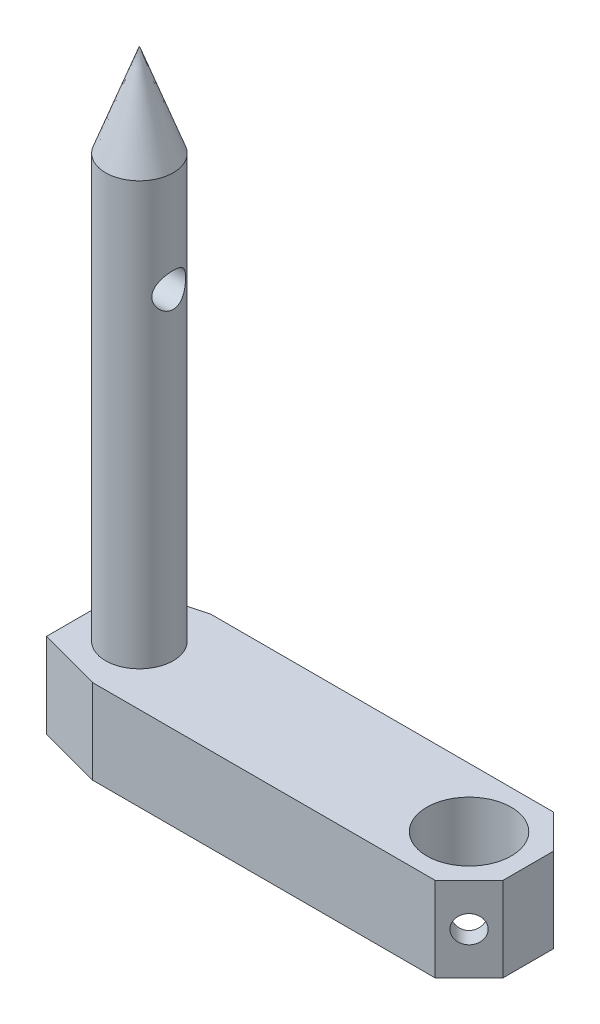
ISO-10303-21;
HEADER;
FILE_DESCRIPTION(('STEP AP214'),'2;1');
FILE_NAME('part.step','',(''),(''),'','','');
FILE_SCHEMA(('AUTOMOTIVE_DESIGN { 1 0 10303 214 1 1 1 1 }'));
ENDSEC;
DATA;
#1=APPLICATION_CONTEXT('core data for automotive mechanical design processes');
#2=APPLICATION_PROTOCOL_DEFINITION('international standard','automotive_design',2000,#1);
#3=PRODUCT_CONTEXT('',#1,'mechanical');
#4=PRODUCT('Part','Part','',(#3));
#5=PRODUCT_RELATED_PRODUCT_CATEGORY('part','',(#4));
#6=PRODUCT_DEFINITION_FORMATION('','',#4);
#7=PRODUCT_DEFINITION_CONTEXT('part definition',#1,'design');
#8=PRODUCT_DEFINITION('design','',#6,#7);
#9=PRODUCT_DEFINITION_SHAPE('','',#8);
#10=(LENGTH_UNIT() NAMED_UNIT(*) SI_UNIT(.MILLI.,.METRE.));
#11=(NAMED_UNIT(*) PLANE_ANGLE_UNIT() SI_UNIT($,.RADIAN.));
#12=(NAMED_UNIT(*) SI_UNIT($,.STERADIAN.) SOLID_ANGLE_UNIT());
#13=UNCERTAINTY_MEASURE_WITH_UNIT(LENGTH_MEASURE(1.E-05),#10,'distance_accuracy_value','');
#14=(GEOMETRIC_REPRESENTATION_CONTEXT(3) GLOBAL_UNCERTAINTY_ASSIGNED_CONTEXT((#13)) GLOBAL_UNIT_ASSIGNED_CONTEXT((#10,
#11,#12)) REPRESENTATION_CONTEXT('',''));
#15=CARTESIAN_POINT('',(0.,0.,0.));
#16=DIRECTION('',(0.,0.,1.));
#17=DIRECTION('',(1.,0.,0.));
#18=AXIS2_PLACEMENT_3D('',#15,#16,#17);
#19=CARTESIAN_POINT('',(0.,25.,0.));
#20=DIRECTION('',(0.,-1.,0.));
#21=DIRECTION('',(-1.,0.,0.));
#22=AXIS2_PLACEMENT_3D('',#19,#20,#21);
#23=CONICAL_SURFACE('',#22,2.,0.349065850398867);
#24=CARTESIAN_POINT('',(0.,30.4949548389092,0.));
#25=VERTEX_POINT('',#24);
#26=VERTEX_LOOP('',#25);
#27=FACE_BOUND('',#26,.T.);
#28=CARTESIAN_POINT('',(0.,25.,0.));
#29=DIRECTION('',(0.,1.,0.));
#30=DIRECTION('',(-1.,0.,0.));
#31=AXIS2_PLACEMENT_3D('',#28,#29,#30);
#32=CIRCLE('',#31,2.);
#33=CARTESIAN_POINT('',(-2.,25.,0.));
#34=VERTEX_POINT('',#33);
#35=EDGE_CURVE('P0_E11',#34,#34,#32,.T.);
#36=ORIENTED_EDGE('',*,*,#35,.T.);
#37=EDGE_LOOP('',(#36));
#38=FACE_BOUND('',#37,.T.);
#39=ADVANCED_FACE('P0_F17',(#27,#38),#23,.T.);
#40=CARTESIAN_POINT('',(0.,25.,0.));
#41=DIRECTION('',(0.,1.,0.));
#42=DIRECTION('',(-1.,0.,0.));
#43=AXIS2_PLACEMENT_3D('',#40,#41,#42);
#44=PLANE('',#43);
#45=ORIENTED_EDGE('',*,*,#35,.F.);
#46=EDGE_LOOP('',(#45));
#47=FACE_BOUND('',#46,.T.);
#48=ADVANCED_FACE('P0_F26',(#47),#44,.F.);
#49=CLOSED_SHELL('',(#39,#48));
#50=MANIFOLD_SOLID_BREP('P0_B1',#49);
#51=CARTESIAN_POINT('',(0.,25.,0.));
#52=DIRECTION('',(0.,-1.,0.));
#53=DIRECTION('',(1.,0.,0.));
#54=AXIS2_PLACEMENT_3D('',#51,#52,#53);
#55=CYLINDRICAL_SURFACE('',#54,2.);
#56=CARTESIAN_POINT('',(2.,20.,0.));
#57=CARTESIAN_POINT('',(1.99999713404151,19.9999966976805,-0.0525719629529876));
#58=CARTESIAN_POINT('',(1.99790491019517,19.9958299268783,-0.105206599698033));
#59=CARTESIAN_POINT('',(1.98974156037396,19.9793471196591,-0.208920235268426));
#60=CARTESIAN_POINT('',(1.98366287828983,19.9670156070023,-0.259996086713505));
#61=CARTESIAN_POINT('',(1.96816279403311,19.9348061913832,-0.358933544880576));
#62=CARTESIAN_POINT('',(1.9587543917752,19.914957615752,-0.406806802939181));
#63=CARTESIAN_POINT('',(1.93745776515778,19.8684293786351,-0.498472616806565));
#64=CARTESIAN_POINT('',(1.9255697363353,19.8417502557511,-0.54226549399005));
#65=CARTESIAN_POINT('',(1.89956258258057,19.7804827505147,-0.62750781776192));
#66=CARTESIAN_POINT('',(1.88535199127536,19.7455135207604,-0.668655211122112));
#67=CARTESIAN_POINT('',(1.85659970246744,19.669478520753,-0.744779444866978));
#68=CARTESIAN_POINT('',(1.84205776209035,19.6284081482276,-0.779751583106767));
#69=CARTESIAN_POINT('',(1.81298951197347,19.5375166504766,-0.84525200045028));
#70=CARTESIAN_POINT('',(1.79855186970132,19.4872639016541,-0.875225335551639));
#71=CARTESIAN_POINT('',(1.7728597877232,19.3816326640138,-0.926168226890697));
#72=CARTESIAN_POINT('',(1.7616030760699,19.3262578712772,-0.947144214966335));
#73=CARTESIAN_POINT('',(1.74457867037808,19.2153348945781,-0.978132442188589));
#74=CARTESIAN_POINT('',(1.73852271583713,19.1599955479326,-0.988725857080442));
#75=CARTESIAN_POINT('',(1.73181889948528,19.0480211622205,-1.00042699330885));
#76=CARTESIAN_POINT('',(1.73116569343288,18.9913874591288,-1.00154408837307));
#77=CARTESIAN_POINT('',(1.73510930257248,18.8857139756846,-0.994687287172295));
#78=CARTESIAN_POINT('',(1.73908763662013,18.836575968777,-0.987784559536823));
#79=CARTESIAN_POINT('',(1.7507622873385,18.740278090627,-0.966939849056934));
#80=CARTESIAN_POINT('',(1.75845978831776,18.6931188546947,-0.952995623897653));
#81=CARTESIAN_POINT('',(1.77687476412741,18.6007708674343,-0.918209780386005));
#82=CARTESIAN_POINT('',(1.78765840663998,18.5556536012142,-0.897215067115995));
#83=CARTESIAN_POINT('',(1.81103404281404,18.46936570741,-0.849041687668002));
#84=CARTESIAN_POINT('',(1.82362684780191,18.4281968643999,-0.821860243812467));
#85=CARTESIAN_POINT('',(1.85113157903286,18.3454787472568,-0.758066054912789));
#86=CARTESIAN_POINT('',(1.86613510236746,18.3045431264238,-0.720694458369283));
#87=CARTESIAN_POINT('',(1.89547623300407,18.2292645814091,-0.639555578741376));
#88=CARTESIAN_POINT('',(1.90981351958801,18.1949248079661,-0.595785256574288));
#89=CARTESIAN_POINT('',(1.93701987282964,18.1323143389703,-0.500516505831851));
#90=CARTESIAN_POINT('',(1.94978984162007,18.1043995275543,-0.448753591599411));
#91=CARTESIAN_POINT('',(1.97157881121242,18.057902970957,-0.3404662154888));
#92=CARTESIAN_POINT('',(1.98060078943553,18.0393138149848,-0.283945576265279));
#93=CARTESIAN_POINT('',(1.99324333741436,18.0135245962833,-0.172766491660705));
#94=CARTESIAN_POINT('',(1.99724938301312,18.0055087642532,-0.118341530548327));
#95=CARTESIAN_POINT('',(2.00073013459102,17.9985352688655,-0.00877959994935637));
#96=CARTESIAN_POINT('',(2.00020698721312,17.9995733143605,0.0463570198698988));
#97=CARTESIAN_POINT('',(1.99491192253441,18.0102066884188,0.151232971985991));
#98=CARTESIAN_POINT('',(1.9904724568819,18.01913253273,0.201059408049952));
#99=CARTESIAN_POINT('',(1.97822171314819,18.0442380718951,0.298406892301914));
#100=CARTESIAN_POINT('',(1.97041006334332,18.0604185664534,0.345927685690995));
#101=CARTESIAN_POINT('',(1.95184251413669,18.0999984664332,0.438888608449663));
#102=CARTESIAN_POINT('',(1.94100881769939,18.1235910501168,0.48423039700615));
#103=CARTESIAN_POINT('',(1.91743974317109,18.177107535646,0.570461361698917));
#104=CARTESIAN_POINT('',(1.90470355565785,18.2070341345934,0.611348629775279));
#105=CARTESIAN_POINT('',(1.87708221337464,18.2757604253329,0.691767689290651));
#106=CARTESIAN_POINT('',(1.86210884848441,18.3151428684536,0.730772077824637));
#107=CARTESIAN_POINT('',(1.83262391603874,18.3999251512693,0.801856321113239));
#108=CARTESIAN_POINT('',(1.81811267381526,18.4453291188164,0.83393138569084));
#109=CARTESIAN_POINT('',(1.79051192226068,18.5436436542003,0.891707914497694));
#110=CARTESIAN_POINT('',(1.77752529663472,18.5968112662086,0.917025495878636));
#111=CARTESIAN_POINT('',(1.75574072368126,18.7075100676925,0.958082826013801));
#112=CARTESIAN_POINT('',(1.74693738240618,18.7650355265012,0.973834915887568));
#113=CARTESIAN_POINT('',(1.73561501008667,18.8769102228614,0.993861687449677));
#114=CARTESIAN_POINT('',(1.73257383460491,18.931034253429,0.999092996400862));
#115=CARTESIAN_POINT('',(1.73165354646175,19.0394470671707,1.00068915438078));
#116=CARTESIAN_POINT('',(1.73377219627553,19.0937357687394,0.997057846624397));
#117=CARTESIAN_POINT('',(1.74237862050025,19.195483501532,0.981926125592261));
#118=CARTESIAN_POINT('',(1.74843094482394,19.2431004701444,0.971208314342798));
#119=CARTESIAN_POINT('',(1.76371016187917,19.3358081194247,0.943175358224643));
#120=CARTESIAN_POINT('',(1.77293807569675,19.380897982092,0.925858091159808));
#121=CARTESIAN_POINT('',(1.79428530364528,19.4706248509866,0.883815745300681));
#122=CARTESIAN_POINT('',(1.8065572239619,19.5150279018297,0.858671137816456));
#123=CARTESIAN_POINT('',(1.8323533163459,19.5992745361806,0.802150971636633));
#124=CARTESIAN_POINT('',(1.84587813794522,19.6391157305185,0.770772171238647));
#125=CARTESIAN_POINT('',(1.87462323159313,19.7181419823576,0.69820332666464));
#126=CARTESIAN_POINT('',(1.88984983311468,19.7566591023619,0.656284423010169));
#127=CARTESIAN_POINT('',(1.91877752255088,19.8262629834236,0.566154806220277));
#128=CARTESIAN_POINT('',(1.9324777860804,19.8573457394263,0.517940723256783));
#129=CARTESIAN_POINT('',(1.95698009585103,19.9112363627622,0.415931596819945));
#130=CARTESIAN_POINT('',(1.96776096562909,19.9339841694114,0.362099503934612));
#131=CARTESIAN_POINT('',(1.98501341363465,19.969808167919,0.25074210129419));
#132=CARTESIAN_POINT('',(1.99149723372932,19.9829118468296,0.193227799623166));
#133=CARTESIAN_POINT('',(1.99695461909663,19.9938974110758,0.112601946483384));
#134=CARTESIAN_POINT('',(1.99809365339201,19.9961826408636,0.0901618794394984));
#135=CARTESIAN_POINT('',(1.99961696977865,19.9992346655168,0.0451517318071569));
#136=CARTESIAN_POINT('',(2.00000123103763,20.0000014184712,0.0225816476473804));
#137=CARTESIAN_POINT('',(2.,20.,0.));
#138=B_SPLINE_CURVE_WITH_KNOTS('',3,(#56,#57,#58,#59,#60,#61,#62,#63,#64,#65,#66,#67,#68,#69,
#70,#71,#72,#73,#74,#75,#76,#77,#78,#79,#80,#81,#82,#83,#84,#85,#86,#87,#88,#89,#90,#91,#92,#93,
#94,#95,#96,#97,#98,#99,#100,#101,#102,#103,#104,#105,#106,#107,#108,#109,#110,#111,#112,#113,
#114,#115,#116,#117,#118,#119,#120,#121,#122,#123,#124,#125,#126,#127,#128,#129,#130,#131,#132,
#133,#134,#135,#136,#137),.UNSPECIFIED.,.T.,.F.,(4,2,2,2,2,2,2,2,2,2,2,2,2,2,2,2,2,2,2,2,2,2,2,
2,2,2,2,2,2,2,2,2,2,2,2,2,2,2,2,2,4),(0.,0.157624257420292,0.315548149709198,0.472862155492298,
0.630163760581567,0.796981758718089,0.963926237654036,1.14381726430753,1.32357947898281,
1.49258012140229,1.6614135732902,1.8100571240932,1.95874803925678,2.11090240168487,
2.26312521260222,2.43464941333878,2.60625534598686,2.7858302221444,2.96526216912279,
3.12983290471345,3.29432564511475,3.44606906506121,3.59782921630931,3.75392856027898,
3.91009450748339,4.08159610644418,4.25321588615431,4.43314682159674,4.61284511940777,
4.77529307498373,4.93767059860005,5.08457930244182,5.23153528783677,5.38836456775614,
5.54527561138957,5.72125242752498,5.89732383376572,6.07464013662924,6.25144908624929,
6.31915280137697,6.38685838514846),.UNSPECIFIED.);
#139=CARTESIAN_POINT('',(2.,20.,0.));
#140=VERTEX_POINT('',#139);
#141=EDGE_CURVE('P1_E9',#140,#140,#138,.T.);
#142=ORIENTED_EDGE('',*,*,#141,.T.);
#143=EDGE_LOOP('',(#142));
#144=FACE_BOUND('',#143,.T.);
#145=CARTESIAN_POINT('',(-1.73205080756888,19.,0.999999999999998));
#146=CARTESIAN_POINT('',(-1.73205534728459,18.9478921918048,0.999996363074529));
#147=CARTESIAN_POINT('',(-1.73443801187757,18.895718588475,0.995899970733214));
#148=CARTESIAN_POINT('',(-1.74362366452053,18.7929727353228,0.979723209898051));
#149=CARTESIAN_POINT('',(-1.7504359405556,18.7424040849566,0.967626064554177));
#150=CARTESIAN_POINT('',(-1.76749346605399,18.6445483356561,0.936099948699811));
#151=CARTESIAN_POINT('',(-1.77772043473252,18.5972453475264,0.916709952493729));
#152=CARTESIAN_POINT('',(-1.80042664816858,18.5065757980033,0.87126752537637));
#153=CARTESIAN_POINT('',(-1.81290601476065,18.4632094497375,0.845214734035772));
#154=CARTESIAN_POINT('',(-1.83996869057441,18.3776942714425,0.784666540530878));
#155=CARTESIAN_POINT('',(-1.85464063637954,18.3359408643265,0.74965203614377));
#156=CARTESIAN_POINT('',(-1.88371982785706,18.2585916115933,0.673253807614467));
#157=CARTESIAN_POINT('',(-1.8981269383125,18.2229988374165,0.631866925782292));
#158=CARTESIAN_POINT('',(-1.92621476952949,18.1566328488523,0.540489563414544));
#159=CARTESIAN_POINT('',(-1.93978106418173,18.1263462321405,0.490107189012574));
#160=CARTESIAN_POINT('',(-1.96350756099529,18.0748591467542,0.384157026599503));
#161=CARTESIAN_POINT('',(-1.97366991183742,18.0536529438628,0.328592538138154));
#162=CARTESIAN_POINT('',(-1.98880461244238,18.0224953386989,0.218044943925976));
#163=CARTESIAN_POINT('',(-1.99409480220892,18.0118504736445,0.163301790488817));
#164=CARTESIAN_POINT('',(-2.00007583846067,17.999833881325,0.052570628697848));
#165=CARTESIAN_POINT('',(-2.0007694678459,17.9984565432043,-0.00341660584373862));
#166=CARTESIAN_POINT('',(-1.9976298191645,18.0047466739703,-0.10983252442375));
#167=CARTESIAN_POINT('',(-1.99418495892161,18.0116380155212,-0.160321199176792));
#168=CARTESIAN_POINT('',(-1.98374245259748,18.0328808439047,-0.259313771918323));
#169=CARTESIAN_POINT('',(-1.97674454066394,18.0472328889762,-0.307817521093926));
#170=CARTESIAN_POINT('',(-1.95971583287654,18.0830825660898,-0.402309391569554));
#171=CARTESIAN_POINT('',(-1.94964441529199,18.1046763131721,-0.448253423515179));
#172=CARTESIAN_POINT('',(-1.92737645986687,18.1542634162015,-0.535976801513329));
#173=CARTESIAN_POINT('',(-1.91517916157484,18.1822590633024,-0.577754648838647));
#174=CARTESIAN_POINT('',(-1.88844394399229,18.246895351533,-0.660173660898195));
#175=CARTESIAN_POINT('',(-1.87379375998175,18.284103028326,-0.70033407502936));
#176=CARTESIAN_POINT('',(-1.84454340586812,18.3645897249302,-0.774104370297779));
#177=CARTESIAN_POINT('',(-1.82994328265629,18.4078733722741,-0.807709211574231));
#178=CARTESIAN_POINT('',(-1.80144156092485,18.5026481924241,-0.869505334642212));
#179=CARTESIAN_POINT('',(-1.78764319990708,18.5544860230542,-0.897217314978051));
#180=CARTESIAN_POINT('',(-1.76375450278576,18.662937671359,-0.943319113001231));
#181=CARTESIAN_POINT('',(-1.75366030046068,18.7195464330176,-0.961718658210889));
#182=CARTESIAN_POINT('',(-1.73944635817035,18.8312145112828,-0.987180211025041));
#183=CARTESIAN_POINT('',(-1.73491655848497,18.8860411190436,-0.995025122119976));
#184=CARTESIAN_POINT('',(-1.7311791936161,18.9964013415165,-1.00151694661143));
#185=CARTESIAN_POINT('',(-1.73196786889312,19.0519344291198,-1.00017035731503));
#186=CARTESIAN_POINT('',(-1.73834336540585,19.1556539185787,-0.989036043343966));
#187=CARTESIAN_POINT('',(-1.74339587506654,19.2039794511079,-0.980187816712467));
#188=CARTESIAN_POINT('',(-1.75694021551341,19.298367786271,-0.955696284632441));
#189=CARTESIAN_POINT('',(-1.76543316005034,19.3444298507466,-0.940050778623615));
#190=CARTESIAN_POINT('',(-1.78536222079657,19.4354113309027,-0.901647588604886));
#191=CARTESIAN_POINT('',(-1.79691643243063,19.4801790168536,-0.878594063692722));
#192=CARTESIAN_POINT('',(-1.8215611949725,19.565469271539,-0.826287064015803));
#193=CARTESIAN_POINT('',(-1.83465253355148,19.6059896435133,-0.797030404332216));
#194=CARTESIAN_POINT('',(-1.86287998456336,19.6869787675235,-0.728837167198854));
#195=CARTESIAN_POINT('',(-1.87806583154289,19.7267971507177,-0.689145272314966));
#196=CARTESIAN_POINT('',(-1.90734234977893,19.7994122379936,-0.603404495398287));
#197=CARTESIAN_POINT('',(-1.92143265007709,19.8322065702305,-0.557353474655347));
#198=CARTESIAN_POINT('',(-1.94741361690957,19.8905737259501,-0.458535362558758));
#199=CARTESIAN_POINT('',(-1.95923641672029,19.9159331182109,-0.405623097574114));
#200=CARTESIAN_POINT('',(-1.97883354959301,19.9571379038574,-0.295522364641083));
#201=CARTESIAN_POINT('',(-1.98661143676373,19.9729916513663,-0.238337701392177));
#202=CARTESIAN_POINT('',(-1.99667508181883,19.9933685641747,-0.126979682330418));
#203=CARTESIAN_POINT('',(-1.99939927908191,19.9987978758761,-0.0730114438504582));
#204=CARTESIAN_POINT('',(-2.00042130375131,20.0008432654544,0.0351259859512024));
#205=CARTESIAN_POINT('',(-1.9987206806689,19.9974624285236,0.0892951002950858));
#206=CARTESIAN_POINT('',(-1.99133968837923,19.9825835932044,0.192537992317146));
#207=CARTESIAN_POINT('',(-1.9859289466799,19.9716351507423,0.241712317811262));
#208=CARTESIAN_POINT('',(-1.97192093663423,19.942673000697,0.337445952183616));
#209=CARTESIAN_POINT('',(-1.96332321132796,19.9246582799065,0.384004884955507));
#210=CARTESIAN_POINT('',(-1.9432593074812,19.881272947834,0.475423406244883));
#211=CARTESIAN_POINT('',(-1.93168617198799,19.8556206767922,0.520125142700045));
#212=CARTESIAN_POINT('',(-1.90688133141826,19.7980420691409,0.604774641814023));
#213=CARTESIAN_POINT('',(-1.89364886558361,19.7661128508843,0.644720207414906));
#214=CARTESIAN_POINT('',(-1.86528610226628,19.6932028609773,0.722914004156891));
#215=CARTESIAN_POINT('',(-1.85009799011698,19.6516375125228,0.760597684539271));
#216=CARTESIAN_POINT('',(-1.82063076162852,19.5625492788702,0.828663287394673));
#217=CARTESIAN_POINT('',(-1.80635245761865,19.5150211791323,0.859038750010057));
#218=CARTESIAN_POINT('',(-1.77999605304916,19.413363353419,0.912431079785653));
#219=CARTESIAN_POINT('',(-1.7680017425627,19.3590724688713,0.935185065960937));
#220=CARTESIAN_POINT('',(-1.74866156328352,19.2466675956602,0.970878709506409));
#221=CARTESIAN_POINT('',(-1.74130016147702,19.1885671110873,0.983851191175343));
#222=CARTESIAN_POINT('',(-1.73529272601791,19.108194644348,0.994367007864412));
#223=CARTESIAN_POINT('',(-1.73408129005152,19.0866321056021,0.996476104963849));
#224=CARTESIAN_POINT('',(-1.7324593588775,19.0433835193178,0.999293405089961));
#225=CARTESIAN_POINT('',(-1.73204891725109,19.0216974636141,1.00000151439987));
#226=CARTESIAN_POINT('',(-1.73205080756888,19.,0.999999999999998));
#227=B_SPLINE_CURVE_WITH_KNOTS('',3,(#145,#146,#147,#148,#149,#150,#151,#152,#153,#154,#155,
#156,#157,#158,#159,#160,#161,#162,#163,#164,#165,#166,#167,#168,#169,#170,#171,#172,#173,#174,
#175,#176,#177,#178,#179,#180,#181,#182,#183,#184,#185,#186,#187,#188,#189,#190,#191,#192,#193,
#194,#195,#196,#197,#198,#199,#200,#201,#202,#203,#204,#205,#206,#207,#208,#209,#210,#211,#212,
#213,#214,#215,#216,#217,#218,#219,#220,#221,#222,#223,#224,#225,#226),.UNSPECIFIED.,.T.,.F.,(4,
2,2,2,2,2,2,2,2,2,2,2,2,2,2,2,2,2,2,2,2,2,2,2,2,2,2,2,2,2,2,2,2,2,2,2,2,2,2,2,4),(0.,
0.156232122594717,0.312792892824805,0.468528595918883,0.624272725445148,0.792862312498229,
0.961535710843709,1.14157892238763,1.32150826963891,1.48863484967935,1.6556602368604,
1.80816097484538,1.96067312517455,2.11529534731146,2.26997299350271,2.4392719145689,
2.60870048245918,2.78888841729448,2.96888774211704,3.13462290854211,3.30024093188373,
3.44774183424025,3.59529052436063,3.74967296406088,3.90413486220047,4.07806743580613,
4.25205864978202,4.43064181412965,4.60906779808771,4.77112270389486,4.93312086793971,
5.08444424871492,5.23578933512012,5.39360750719471,5.55149830100718,5.72510241850067,
5.89885942845154,6.07810749038604,6.25675133002759,6.32180135185309,6.3868557249454),.UNSPECIFIED.);
#228=CARTESIAN_POINT('',(-1.73205080756888,19.,0.999999999999998));
#229=VERTEX_POINT('',#228);
#230=EDGE_CURVE('P1_E25',#229,#229,#227,.T.);
#231=ORIENTED_EDGE('',*,*,#230,.T.);
#232=EDGE_LOOP('',(#231));
#233=FACE_BOUND('',#232,.T.);
#234=CARTESIAN_POINT('',(0.,25.,0.));
#235=DIRECTION('',(0.,1.,0.));
#236=DIRECTION('',(-1.,0.,0.));
#237=AXIS2_PLACEMENT_3D('',#234,#235,#236);
#238=CIRCLE('',#237,2.);
#239=CARTESIAN_POINT('',(-2.,25.,0.));
#240=VERTEX_POINT('',#239);
#241=EDGE_CURVE('P1_E29',#240,#240,#238,.T.);
#242=ORIENTED_EDGE('',*,*,#241,.F.);
#243=EDGE_LOOP('',(#242));
#244=FACE_BOUND('',#243,.T.);
#245=CARTESIAN_POINT('',(0.,-5.,0.));
#246=DIRECTION('',(0.,1.,0.));
#247=DIRECTION('',(-1.,0.,0.));
#248=AXIS2_PLACEMENT_3D('',#245,#246,#247);
#249=CIRCLE('',#248,2.);
#250=CARTESIAN_POINT('',(-2.,-5.,0.));
#251=VERTEX_POINT('',#250);
#252=EDGE_CURVE('P1_E33',#251,#251,#249,.T.);
#253=ORIENTED_EDGE('',*,*,#252,.T.);
#254=EDGE_LOOP('',(#253));
#255=FACE_BOUND('',#254,.T.);
#256=ADVANCED_FACE('P1_F14',(#144,#233,#244,#255),#55,.T.);
#257=CARTESIAN_POINT('',(0.,25.,0.));
#258=DIRECTION('',(0.,1.,0.));
#259=DIRECTION('',(-1.,0.,0.));
#260=AXIS2_PLACEMENT_3D('',#257,#258,#259);
#261=PLANE('',#260);
#262=ORIENTED_EDGE('',*,*,#241,.T.);
#263=EDGE_LOOP('',(#262));
#264=FACE_BOUND('',#263,.T.);
#265=ADVANCED_FACE('P1_F45',(#264),#261,.T.);
#266=CARTESIAN_POINT('',(0.,-5.,0.));
#267=DIRECTION('',(0.,1.,0.));
#268=DIRECTION('',(-1.,0.,0.));
#269=AXIS2_PLACEMENT_3D('',#266,#267,#268);
#270=PLANE('',#269);
#271=ORIENTED_EDGE('',*,*,#252,.F.);
#272=EDGE_LOOP('',(#271));
#273=FACE_BOUND('',#272,.T.);
#274=ADVANCED_FACE('P1_F43',(#273),#270,.F.);
#275=CARTESIAN_POINT('',(-2.,19.,0.));
#276=DIRECTION('',(-1.,0.,0.));
#277=DIRECTION('',(0.,0.,1.));
#278=AXIS2_PLACEMENT_3D('',#275,#276,#277);
#279=CYLINDRICAL_SURFACE('',#278,0.999999999999999);
#280=ORIENTED_EDGE('',*,*,#230,.F.);
#281=EDGE_LOOP('',(#280));
#282=FACE_BOUND('',#281,.T.);
#283=ORIENTED_EDGE('',*,*,#141,.F.);
#284=EDGE_LOOP('',(#283));
#285=FACE_BOUND('',#284,.T.);
#286=ADVANCED_FACE('P1_F39',(#282,#285),#279,.F.);
#287=CLOSED_SHELL('',(#256,#265,#274,#286));
#288=MANIFOLD_SOLID_BREP('P1_B1',#287);
#289=CARTESIAN_POINT('',(0.,-5.,3.5));
#290=DIRECTION('',(0.,0.,1.));
#291=DIRECTION('',(1.,0.,0.));
#292=AXIS2_PLACEMENT_3D('',#289,#290,#291);
#293=PLANE('',#292);
#294=DIRECTION('',(1.,0.,0.));
#295=VECTOR('',#294,1.);
#296=CARTESIAN_POINT('',(0.,0.,3.5));
#297=LINE('',#296,#295);
#298=CARTESIAN_POINT('',(0.732050807568831,0.,3.5));
#299=VERTEX_POINT('',#298);
#300=CARTESIAN_POINT('',(21.,0.,3.5));
#301=VERTEX_POINT('',#300);
#302=EDGE_CURVE('P2_E118',#299,#301,#297,.T.);
#303=ORIENTED_EDGE('',*,*,#302,.F.);
#304=DIRECTION('',(0.,1.,0.));
#305=VECTOR('',#304,1.);
#306=CARTESIAN_POINT('',(0.732050807568831,-5.,3.5));
#307=LINE('',#306,#305);
#308=CARTESIAN_POINT('',(0.732050807568831,-5.,3.5));
#309=VERTEX_POINT('',#308);
#310=EDGE_CURVE('P2_E11',#309,#299,#307,.T.);
#311=ORIENTED_EDGE('',*,*,#310,.F.);
#312=DIRECTION('',(1.,0.,0.));
#313=VECTOR('',#312,1.);
#314=CARTESIAN_POINT('',(0.,-5.,3.5));
#315=LINE('',#314,#313);
#316=CARTESIAN_POINT('',(21.,-5.,3.5));
#317=VERTEX_POINT('',#316);
#318=EDGE_CURVE('P2_E150',#309,#317,#315,.T.);
#319=ORIENTED_EDGE('',*,*,#318,.T.);
#320=DIRECTION('',(0.,1.,0.));
#321=VECTOR('',#320,1.);
#322=CARTESIAN_POINT('',(21.,-5.,3.5));
#323=LINE('',#322,#321);
#324=EDGE_CURVE('P2_E21',#317,#301,#323,.T.);
#325=ORIENTED_EDGE('',*,*,#324,.T.);
#326=EDGE_LOOP('',(#303,#311,#319,#325));
#327=FACE_BOUND('',#326,.T.);
#328=ADVANCED_FACE('P2_F17',(#327),#293,.T.);
#329=CARTESIAN_POINT('',(-0.825961894323354,-5.,3.08253175473055));
#330=DIRECTION('',(-0.258819045102524,0.,0.965925826289068));
#331=DIRECTION('',(0.965925826289068,0.,0.258819045102524));
#332=AXIS2_PLACEMENT_3D('',#329,#330,#331);
#333=PLANE('',#332);
#334=DIRECTION('',(0.965925826289068,0.,0.258819045102524));
#335=VECTOR('',#334,1.);
#336=CARTESIAN_POINT('',(-0.825961894323354,0.,3.08253175473055));
#337=LINE('',#336,#335);
#338=CARTESIAN_POINT('',(-3.,0.,2.5));
#339=VERTEX_POINT('',#338);
#340=EDGE_CURVE('P2_E137',#339,#299,#337,.T.);
#341=ORIENTED_EDGE('',*,*,#340,.F.);
#342=DIRECTION('',(0.,1.,0.));
#343=VECTOR('',#342,1.);
#344=CARTESIAN_POINT('',(-3.,-5.,2.5));
#345=LINE('',#344,#343);
#346=CARTESIAN_POINT('',(-3.,-5.,2.5));
#347=VERTEX_POINT('',#346);
#348=EDGE_CURVE('P2_E27',#347,#339,#345,.T.);
#349=ORIENTED_EDGE('',*,*,#348,.F.);
#350=DIRECTION('',(0.965925826289068,0.,0.258819045102524));
#351=VECTOR('',#350,1.);
#352=CARTESIAN_POINT('',(-0.825961894323354,-5.,3.08253175473055));
#353=LINE('',#352,#351);
#354=EDGE_CURVE('P2_E104',#347,#309,#353,.T.);
#355=ORIENTED_EDGE('',*,*,#354,.T.);
#356=ORIENTED_EDGE('',*,*,#310,.T.);
#357=EDGE_LOOP('',(#341,#349,#355,#356));
#358=FACE_BOUND('',#357,.T.);
#359=ADVANCED_FACE('P2_F154',(#358),#333,.T.);
#360=CARTESIAN_POINT('',(-3.,-5.,0.));
#361=DIRECTION('',(-1.,0.,0.));
#362=DIRECTION('',(0.,0.,1.));
#363=AXIS2_PLACEMENT_3D('',#360,#361,#362);
#364=PLANE('',#363);
#365=DIRECTION('',(0.,0.,1.));
#366=VECTOR('',#365,1.);
#367=CARTESIAN_POINT('',(-3.,0.,0.));
#368=LINE('',#367,#366);
#369=CARTESIAN_POINT('',(-3.,0.,-2.5));
#370=VERTEX_POINT('',#369);
#371=EDGE_CURVE('P2_E92',#370,#339,#368,.T.);
#372=ORIENTED_EDGE('',*,*,#371,.F.);
#373=DIRECTION('',(0.,1.,0.));
#374=VECTOR('',#373,1.);
#375=CARTESIAN_POINT('',(-3.,-5.,-2.5));
#376=LINE('',#375,#374);
#377=CARTESIAN_POINT('',(-3.,-5.,-2.5));
#378=VERTEX_POINT('',#377);
#379=EDGE_CURVE('P2_E87',#378,#370,#376,.T.);
#380=ORIENTED_EDGE('',*,*,#379,.F.);
#381=DIRECTION('',(0.,0.,1.));
#382=VECTOR('',#381,1.);
#383=CARTESIAN_POINT('',(-3.,-5.,0.));
#384=LINE('',#383,#382);
#385=EDGE_CURVE('P2_E90',#378,#347,#384,.T.);
#386=ORIENTED_EDGE('',*,*,#385,.T.);
#387=ORIENTED_EDGE('',*,*,#348,.T.);
#388=EDGE_LOOP('',(#372,#380,#386,#387));
#389=FACE_BOUND('',#388,.T.);
#390=ADVANCED_FACE('P2_F89',(#389),#364,.T.);
#391=CARTESIAN_POINT('',(-0.825961894323355,-5.,-3.08253175473055));
#392=DIRECTION('',(-0.258819045102524,0.,-0.965925826289068));
#393=DIRECTION('',(-0.965925826289068,0.,0.258819045102524));
#394=AXIS2_PLACEMENT_3D('',#391,#392,#393);
#395=PLANE('',#394);
#396=DIRECTION('',(-0.965925826289067,0.,0.258819045102524));
#397=VECTOR('',#396,1.);
#398=CARTESIAN_POINT('',(-0.825961894323355,0.,-3.08253175473055));
#399=LINE('',#398,#397);
#400=CARTESIAN_POINT('',(0.732050807568824,0.,-3.5));
#401=VERTEX_POINT('',#400);
#402=EDGE_CURVE('P2_E134',#401,#370,#399,.T.);
#403=ORIENTED_EDGE('',*,*,#402,.F.);
#404=DIRECTION('',(0.,1.,0.));
#405=VECTOR('',#404,1.);
#406=CARTESIAN_POINT('',(0.732050807568824,-5.,-3.5));
#407=LINE('',#406,#405);
#408=CARTESIAN_POINT('',(0.732050807568824,-5.,-3.5));
#409=VERTEX_POINT('',#408);
#410=EDGE_CURVE('P2_E97',#409,#401,#407,.T.);
#411=ORIENTED_EDGE('',*,*,#410,.F.);
#412=DIRECTION('',(-0.965925826289067,0.,0.258819045102524));
#413=VECTOR('',#412,1.);
#414=CARTESIAN_POINT('',(-0.825961894323355,-5.,-3.08253175473055));
#415=LINE('',#414,#413);
#416=EDGE_CURVE('P2_E103',#409,#378,#415,.T.);
#417=ORIENTED_EDGE('',*,*,#416,.T.);
#418=ORIENTED_EDGE('',*,*,#379,.T.);
#419=EDGE_LOOP('',(#403,#411,#417,#418));
#420=FACE_BOUND('',#419,.T.);
#421=ADVANCED_FACE('P2_F106',(#420),#395,.T.);
#422=CARTESIAN_POINT('',(0.,-5.,-3.5));
#423=DIRECTION('',(0.,0.,1.));
#424=DIRECTION('',(1.,0.,0.));
#425=AXIS2_PLACEMENT_3D('',#422,#423,#424);
#426=PLANE('',#425);
#427=DIRECTION('',(1.,0.,0.));
#428=VECTOR('',#427,1.);
#429=CARTESIAN_POINT('',(0.,0.,-3.5));
#430=LINE('',#429,#428);
#431=CARTESIAN_POINT('',(21.,0.,-3.5));
#432=VERTEX_POINT('',#431);
#433=EDGE_CURVE('P2_E131',#401,#432,#430,.T.);
#434=ORIENTED_EDGE('',*,*,#433,.T.);
#435=DIRECTION('',(0.,1.,0.));
#436=VECTOR('',#435,1.);
#437=CARTESIAN_POINT('',(21.,-5.,-3.5));
#438=LINE('',#437,#436);
#439=CARTESIAN_POINT('',(21.,-5.,-3.5));
#440=VERTEX_POINT('',#439);
#441=EDGE_CURVE('P2_E143',#440,#432,#438,.T.);
#442=ORIENTED_EDGE('',*,*,#441,.F.);
#443=DIRECTION('',(1.,0.,0.));
#444=VECTOR('',#443,1.);
#445=CARTESIAN_POINT('',(0.,-5.,-3.5));
#446=LINE('',#445,#444);
#447=EDGE_CURVE('P2_E108',#409,#440,#446,.T.);
#448=ORIENTED_EDGE('',*,*,#447,.F.);
#449=ORIENTED_EDGE('',*,*,#410,.T.);
#450=EDGE_LOOP('',(#434,#442,#448,#449));
#451=FACE_BOUND('',#450,.T.);
#452=ADVANCED_FACE('P2_F168',(#451),#426,.F.);
#453=CARTESIAN_POINT('',(12.25,-5.,-12.25));
#454=DIRECTION('',(-0.707106781186548,0.,0.707106781186547));
#455=DIRECTION('',(0.707106781186547,0.,0.707106781186548));
#456=AXIS2_PLACEMENT_3D('',#453,#454,#455);
#457=PLANE('',#456);
#458=CARTESIAN_POINT('',(22.,-2.5,-2.5));
#459=DIRECTION('',(0.707106781186549,0.,-0.707106781186546));
#460=DIRECTION('',(-0.707106781186546,0.,-0.707106781186549));
#461=AXIS2_PLACEMENT_3D('',#458,#459,#460);
#462=CIRCLE('',#461,0.799999999999998);
#463=CARTESIAN_POINT('',(21.4343145750508,-2.5,-3.06568542494924));
#464=VERTEX_POINT('',#463);
#465=EDGE_CURVE('P2_E195',#464,#464,#462,.T.);
#466=ORIENTED_EDGE('',*,*,#465,.F.);
#467=EDGE_LOOP('',(#466));
#468=FACE_BOUND('',#467,.T.);
#469=DIRECTION('',(0.707106781186547,0.,0.707106781186548));
#470=VECTOR('',#469,1.);
#471=CARTESIAN_POINT('',(12.25,0.,-12.25));
#472=LINE('',#471,#470);
#473=CARTESIAN_POINT('',(23.,0.,-1.5));
#474=VERTEX_POINT('',#473);
#475=EDGE_CURVE('P2_E128',#432,#474,#472,.T.);
#476=ORIENTED_EDGE('',*,*,#475,.T.);
#477=DIRECTION('',(0.,1.,0.));
#478=VECTOR('',#477,1.);
#479=CARTESIAN_POINT('',(23.,-5.,-1.5));
#480=LINE('',#479,#478);
#481=CARTESIAN_POINT('',(23.,-5.,-1.5));
#482=VERTEX_POINT('',#481);
#483=EDGE_CURVE('P2_E146',#482,#474,#480,.T.);
#484=ORIENTED_EDGE('',*,*,#483,.F.);
#485=DIRECTION('',(0.707106781186547,0.,0.707106781186548));
#486=VECTOR('',#485,1.);
#487=CARTESIAN_POINT('',(12.25,-5.,-12.25));
#488=LINE('',#487,#486);
#489=EDGE_CURVE('P2_E110',#440,#482,#488,.T.);
#490=ORIENTED_EDGE('',*,*,#489,.F.);
#491=ORIENTED_EDGE('',*,*,#441,.T.);
#492=EDGE_LOOP('',(#476,#484,#490,#491));
#493=FACE_BOUND('',#492,.T.);
#494=ADVANCED_FACE('P2_F171',(#468,#493),#457,.F.);
#495=CARTESIAN_POINT('',(23.,-5.,0.));
#496=DIRECTION('',(-1.,0.,0.));
#497=DIRECTION('',(0.,0.,1.));
#498=AXIS2_PLACEMENT_3D('',#495,#496,#497);
#499=PLANE('',#498);
#500=DIRECTION('',(0.,0.,1.));
#501=VECTOR('',#500,1.);
#502=CARTESIAN_POINT('',(23.,0.,0.));
#503=LINE('',#502,#501);
#504=CARTESIAN_POINT('',(23.,0.,1.50000000000001));
#505=VERTEX_POINT('',#504);
#506=EDGE_CURVE('P2_E125',#474,#505,#503,.T.);
#507=ORIENTED_EDGE('',*,*,#506,.T.);
#508=DIRECTION('',(0.,1.,0.));
#509=VECTOR('',#508,1.);
#510=CARTESIAN_POINT('',(23.,-5.,1.50000000000001));
#511=LINE('',#510,#509);
#512=CARTESIAN_POINT('',(23.,-5.,1.50000000000001));
#513=VERTEX_POINT('',#512);
#514=EDGE_CURVE('P2_E148',#513,#505,#511,.T.);
#515=ORIENTED_EDGE('',*,*,#514,.F.);
#516=DIRECTION('',(0.,0.,1.));
#517=VECTOR('',#516,1.);
#518=CARTESIAN_POINT('',(23.,-5.,0.));
#519=LINE('',#518,#517);
#520=EDGE_CURVE('P2_E250',#482,#513,#519,.T.);
#521=ORIENTED_EDGE('',*,*,#520,.F.);
#522=ORIENTED_EDGE('',*,*,#483,.T.);
#523=EDGE_LOOP('',(#507,#515,#521,#522));
#524=FACE_BOUND('',#523,.T.);
#525=ADVANCED_FACE('P2_F175',(#524),#499,.F.);
#526=CARTESIAN_POINT('',(19.5,-5.,0.));
#527=DIRECTION('',(0.,1.,0.));
#528=DIRECTION('',(0.,0.,1.));
#529=AXIS2_PLACEMENT_3D('',#526,#527,#528);
#530=CYLINDRICAL_SURFACE('',#529,2.5);
#531=CARTESIAN_POINT('',(21.7404988473937,-2.5,1.10912799749519));
#532=CARTESIAN_POINT('',(21.7404988541167,-2.4563168810223,1.10912818541871));
#533=CARTESIAN_POINT('',(21.7388241767648,-2.41263224816393,1.1125304018607));
#534=CARTESIAN_POINT('',(21.732113868879,-2.32655020622629,1.12593179470893));
#535=CARTESIAN_POINT('',(21.7270774585958,-2.28415309817247,1.13593250161976));
#536=CARTESIAN_POINT('',(21.7136215489733,-2.20190594916675,1.16193440751882));
#537=CARTESIAN_POINT('',(21.7052082599999,-2.16205138734552,1.17792458777334));
#538=CARTESIAN_POINT('',(21.6849436904651,-2.08579117949244,1.21509982738939));
#539=CARTESIAN_POINT('',(21.6730917474474,-2.0493861998166,1.23628588761476));
#540=CARTESIAN_POINT('',(21.6454440363891,-1.97974680243317,1.2836842202225));
#541=CARTESIAN_POINT('',(21.6295320197195,-1.94665491726237,1.31003814826472));
#542=CARTESIAN_POINT('',(21.5939436171637,-1.88585678706832,1.36620054517443));
#543=CARTESIAN_POINT('',(21.5742666794856,-1.85815133268898,1.39600952016539));
#544=CARTESIAN_POINT('',(21.5306971684241,-1.80827730734993,1.45868354616379));
#545=CARTESIAN_POINT('',(21.5067153046472,-1.78625642534535,1.4916044987244));
#546=CARTESIAN_POINT('',(21.4551367795838,-1.7493507180172,1.55859681671745));
#547=CARTESIAN_POINT('',(21.4275410137925,-1.73446412911867,1.59266789561079));
#548=CARTESIAN_POINT('',(21.3702109889945,-1.71272811038582,1.65957469045755));
#549=CARTESIAN_POINT('',(21.34057444976,-1.7056348711692,1.69241479802919));
#550=CARTESIAN_POINT('',(21.2791781047093,-1.69891344724945,1.7568447522647));
#551=CARTESIAN_POINT('',(21.2474188061002,-1.6992834855991,1.78843489474068));
#552=CARTESIAN_POINT('',(21.183936611475,-1.70731975098619,1.84829473803465));
#553=CARTESIAN_POINT('',(21.1522539768443,-1.71472149892031,1.87664322380571));
#554=CARTESIAN_POINT('',(21.0888369923934,-1.73617591162058,1.93062999064361));
#555=CARTESIAN_POINT('',(21.0571026392871,-1.75022901682797,1.95626809209598));
#556=CARTESIAN_POINT('',(20.9942370738243,-1.78475161625891,2.00470732303012));
#557=CARTESIAN_POINT('',(20.9631184679375,-1.80529959079679,2.02746871397409));
#558=CARTESIAN_POINT('',(20.9029661086455,-1.85216510344927,2.06954961660544));
#559=CARTESIAN_POINT('',(20.8739329043215,-1.8784841537353,2.08886822378477));
#560=CARTESIAN_POINT('',(20.8177886514939,-1.93749382086661,2.12475695925679));
#561=CARTESIAN_POINT('',(20.7908165726072,-1.97041218152882,2.14117055718036));
#562=CARTESIAN_POINT('',(20.7414015320426,-2.04099413048974,2.17019482644184));
#563=CARTESIAN_POINT('',(20.7189591592858,-2.0786583347775,2.18280500339054));
#564=CARTESIAN_POINT('',(20.6794287718536,-2.15827837014686,2.20441911446709));
#565=CARTESIAN_POINT('',(20.66240956869,-2.20028103768846,2.21337707737416));
#566=CARTESIAN_POINT('',(20.6350682749203,-2.28701040319528,2.2275232326676));
#567=CARTESIAN_POINT('',(20.6247436385431,-2.33173605859247,2.23271285814559));
#568=CARTESIAN_POINT('',(20.6117173070573,-2.4206319550402,2.23922659867746));
#569=CARTESIAN_POINT('',(20.6087140765745,-2.4647468241569,2.24070369973722));
#570=CARTESIAN_POINT('',(20.6096337901048,-2.55288213526822,2.24024851592345));
#571=CARTESIAN_POINT('',(20.6135555993644,-2.59690259155014,2.23831678962858));
#572=CARTESIAN_POINT('',(20.6278531023916,-2.68218851367629,2.23114483636998));
#573=CARTESIAN_POINT('',(20.6380263436639,-2.7234970733505,2.22600831940711));
#574=CARTESIAN_POINT('',(20.6640915190041,-2.80370557986887,2.21248842478181));
#575=CARTESIAN_POINT('',(20.6799844152127,-2.84260512018495,2.20410450083366));
#576=CARTESIAN_POINT('',(20.7172718927272,-2.91817392358121,2.18373807606431));
#577=CARTESIAN_POINT('',(20.7388162112165,-2.95474227940474,2.17165585061502));
#578=CARTESIAN_POINT('',(20.7862014947658,-3.02348671109181,2.14393050396678));
#579=CARTESIAN_POINT('',(20.8120436293921,-3.05566158700413,2.12828641304743));
#580=CARTESIAN_POINT('',(20.8682106614373,-3.11615955531712,2.0926422503481));
#581=CARTESIAN_POINT('',(20.8986822651239,-3.14425240079187,2.07248148247199));
#582=CARTESIAN_POINT('',(20.9619856153365,-3.19404253863835,2.02832079001998));
#583=CARTESIAN_POINT('',(20.9948172610245,-3.21574010406074,2.00432102941991));
#584=CARTESIAN_POINT('',(21.0613480340638,-3.25191799863385,1.9529322867102));
#585=CARTESIAN_POINT('',(21.095039234485,-3.26644905920689,1.9255688928008));
#586=CARTESIAN_POINT('',(21.1622575220946,-3.28799205205536,1.86784880658013));
#587=CARTESIAN_POINT('',(21.1957846597637,-3.29500646366345,1.83749310487792));
#588=CARTESIAN_POINT('',(21.2600580359578,-3.30110785394987,1.77597545873001));
#589=CARTESIAN_POINT('',(21.2908617970982,-3.30052665751495,1.74490614639337));
#590=CARTESIAN_POINT('',(21.3503422443139,-3.29226145761088,1.68170050288552));
#591=CARTESIAN_POINT('',(21.3790190805558,-3.28457795609982,1.64956424727568));
#592=CARTESIAN_POINT('',(21.4331918914688,-3.26254086461702,1.58571746846321));
#593=CARTESIAN_POINT('',(21.4587259629554,-3.24827981377716,1.55400712571505));
#594=CARTESIAN_POINT('',(21.5066494650578,-3.21357669521386,1.49161230484144));
#595=CARTESIAN_POINT('',(21.5290383434733,-3.19313354408271,1.46092800757718));
#596=CARTESIAN_POINT('',(21.5711806033031,-3.14581944610727,1.40057618973544));
#597=CARTESIAN_POINT('',(21.5908141582918,-3.11874838189769,1.37098196334064));
#598=CARTESIAN_POINT('',(21.626412589917,-3.05929536207991,1.31509297148735));
#599=CARTESIAN_POINT('',(21.6423763395129,-3.02691178015333,1.28879922076634));
#600=CARTESIAN_POINT('',(21.6711562714463,-2.95638667718153,1.23972554536212));
#601=CARTESIAN_POINT('',(21.6838417540485,-2.91808249896281,1.21710204417814));
#602=CARTESIAN_POINT('',(21.7053683159992,-2.83760764716501,1.1776495007583));
#603=CARTESIAN_POINT('',(21.7142107619253,-2.79543835448411,1.16081839919842));
#604=CARTESIAN_POINT('',(21.7276249198159,-2.71150857944311,1.1348507413015));
#605=CARTESIAN_POINT('',(21.7324556973834,-2.66993242204363,1.12525198200641));
#606=CARTESIAN_POINT('',(21.7388922089384,-2.58557110057192,1.11239140019805));
#607=CARTESIAN_POINT('',(21.7404988408087,-2.5427862764644,1.10912781342986));
#608=CARTESIAN_POINT('',(21.7404988473937,-2.5,1.10912799749519));
#609=B_SPLINE_CURVE_WITH_KNOTS('',3,(#531,#532,#533,#534,#535,#536,#537,#538,#539,#540,#541,
#542,#543,#544,#545,#546,#547,#548,#549,#550,#551,#552,#553,#554,#555,#556,#557,#558,#559,#560,
#561,#562,#563,#564,#565,#566,#567,#568,#569,#570,#571,#572,#573,#574,#575,#576,#577,#578,#579,
#580,#581,#582,#583,#584,#585,#586,#587,#588,#589,#590,#591,#592,#593,#594,#595,#596,#597,#598,
#599,#600,#601,#602,#603,#604,#605,#606,#607,#608),.UNSPECIFIED.,.T.,.F.,(4,2,2,2,2,2,2,2,2,2,2,
2,2,2,2,2,2,2,2,2,2,2,2,2,2,2,2,2,2,2,2,2,2,2,2,2,2,2,4),(0.,0.130891168523663,
0.261812707628661,0.392494566159157,0.52320161726922,0.658181086047294,0.793180352769163,
0.93139688741782,1.06957923772488,1.20330337206031,1.33699566811544,1.46585063697655,
1.5947141395825,1.72519845034169,1.85571699231554,1.99192534158374,2.12815138832635,
2.26604280905129,2.40388176242564,2.53593995660066,2.66797651341177,2.79594728163428,
2.92393958672764,3.0557432663747,3.18758287266625,3.32519336185686,3.46279797482663,
3.59941398434422,3.73598491780592,3.86661026401423,3.99722637893302,4.12605842929881,
4.25491307046653,4.38828245677264,4.52169274783304,4.65980300496366,4.79786411004772,
4.92610371676323,5.05430760545675),.UNSPECIFIED.);
#610=CARTESIAN_POINT('',(21.7404988473937,-2.5,1.10912799749519));
#611=VERTEX_POINT('',#610);
#612=EDGE_CURVE('P2_E192',#611,#611,#609,.T.);
#613=ORIENTED_EDGE('',*,*,#612,.T.);
#614=EDGE_LOOP('',(#613));
#615=FACE_BOUND('',#614,.T.);
#616=CARTESIAN_POINT('',(20.6091279974952,-2.5,-2.24049884739366));
#617=CARTESIAN_POINT('',(20.6091281854187,-2.4563168810223,-2.24049885411668));
#618=CARTESIAN_POINT('',(20.6125304018607,-2.41263224816393,-2.23882417676483));
#619=CARTESIAN_POINT('',(20.6259317947089,-2.32655020622629,-2.23211386887905));
#620=CARTESIAN_POINT('',(20.6359325016197,-2.28415309817247,-2.22707745859578));
#621=CARTESIAN_POINT('',(20.6619344075188,-2.20190594916675,-2.21362154897332));
#622=CARTESIAN_POINT('',(20.6779245877733,-2.16205138734552,-2.2052082599999));
#623=CARTESIAN_POINT('',(20.7150998273894,-2.08579117949244,-2.18494369046508));
#624=CARTESIAN_POINT('',(20.7362858876148,-2.0493861998166,-2.17309174744741));
#625=CARTESIAN_POINT('',(20.7836842202225,-1.97974680243316,-2.14544403638909));
#626=CARTESIAN_POINT('',(20.8100381482647,-1.94665491726237,-2.12953201971954));
#627=CARTESIAN_POINT('',(20.8662005451744,-1.88585678706832,-2.09394361716372));
#628=CARTESIAN_POINT('',(20.8960095201654,-1.85815133268898,-2.07426667948564));
#629=CARTESIAN_POINT('',(20.9586835461638,-1.80827730734993,-2.03069716842412));
#630=CARTESIAN_POINT('',(20.9916044987244,-1.78625642534535,-2.00671530464722));
#631=CARTESIAN_POINT('',(21.0585968167175,-1.7493507180172,-1.95513677958383));
#632=CARTESIAN_POINT('',(21.0926678956108,-1.73446412911867,-1.92754101379246));
#633=CARTESIAN_POINT('',(21.1595746904575,-1.71272811038582,-1.87021098899453));
#634=CARTESIAN_POINT('',(21.1924147980292,-1.7056348711692,-1.84057444976));
#635=CARTESIAN_POINT('',(21.2568447522647,-1.69891344724945,-1.77917810470935));
#636=CARTESIAN_POINT('',(21.2884348947407,-1.6992834855991,-1.74741880610021));
#637=CARTESIAN_POINT('',(21.3482947380346,-1.70731975098619,-1.68393661147496));
#638=CARTESIAN_POINT('',(21.3766432238057,-1.71472149892031,-1.65225397684429));
#639=CARTESIAN_POINT('',(21.4306299906436,-1.73617591162057,-1.58883699239339));
#640=CARTESIAN_POINT('',(21.456268092096,-1.75022901682797,-1.55710263928714));
#641=CARTESIAN_POINT('',(21.5047073230301,-1.78475161625891,-1.49423707382427));
#642=CARTESIAN_POINT('',(21.5274687139741,-1.80529959079679,-1.46311846793753));
#643=CARTESIAN_POINT('',(21.5695496166054,-1.85216510344927,-1.40296610864553));
#644=CARTESIAN_POINT('',(21.5888682237848,-1.8784841537353,-1.37393290432149));
#645=CARTESIAN_POINT('',(21.6247569592568,-1.93749382086661,-1.31778865149392));
#646=CARTESIAN_POINT('',(21.6411705571804,-1.97041218152882,-1.29081657260717));
#647=CARTESIAN_POINT('',(21.6701948264418,-2.04099413048974,-1.24140153204261));
#648=CARTESIAN_POINT('',(21.6828050033905,-2.0786583347775,-1.2189591592858));
#649=CARTESIAN_POINT('',(21.7044191144671,-2.15827837014686,-1.17942877185361));
#650=CARTESIAN_POINT('',(21.7133770773742,-2.20028103768846,-1.16240956869004));
#651=CARTESIAN_POINT('',(21.7275232326676,-2.28701040319528,-1.13506827492031));
#652=CARTESIAN_POINT('',(21.7327128581456,-2.33173605859247,-1.12474363854311));
#653=CARTESIAN_POINT('',(21.7392265986775,-2.4206319550402,-1.11171730705733));
#654=CARTESIAN_POINT('',(21.7407036997372,-2.4647468241569,-1.1087140765745));
#655=CARTESIAN_POINT('',(21.7402485159234,-2.55288213526821,-1.10963379010485));
#656=CARTESIAN_POINT('',(21.7383167896286,-2.59690259155014,-1.11355559936442));
#657=CARTESIAN_POINT('',(21.73114483637,-2.68218851367628,-1.12785310239162));
#658=CARTESIAN_POINT('',(21.7260083194071,-2.7234970733505,-1.13802634366389));
#659=CARTESIAN_POINT('',(21.7124884247818,-2.80370557986886,-1.16409151900411));
#660=CARTESIAN_POINT('',(21.7041045008337,-2.84260512018495,-1.17998441521267));
#661=CARTESIAN_POINT('',(21.6837380760643,-2.91817392358121,-1.21727189272725));
#662=CARTESIAN_POINT('',(21.671655850615,-2.95474227940474,-1.23881621121647));
#663=CARTESIAN_POINT('',(21.6439305039668,-3.02348671109181,-1.28620149476584));
#664=CARTESIAN_POINT('',(21.6282864130474,-3.05566158700413,-1.31204362939209));
#665=CARTESIAN_POINT('',(21.5926422503481,-3.11615955531712,-1.36821066143728));
#666=CARTESIAN_POINT('',(21.572481482472,-3.14425240079187,-1.3986822651239));
#667=CARTESIAN_POINT('',(21.52832079002,-3.19404253863835,-1.46198561533654));
#668=CARTESIAN_POINT('',(21.5043210294199,-3.21574010406074,-1.49481726102455));
#669=CARTESIAN_POINT('',(21.4529322867102,-3.25191799863386,-1.56134803406381));
#670=CARTESIAN_POINT('',(21.4255688928008,-3.26644905920689,-1.59503923448506));
#671=CARTESIAN_POINT('',(21.3678488065801,-3.28799205205536,-1.66225752209456));
#672=CARTESIAN_POINT('',(21.3374931048779,-3.29500646366345,-1.69578465976372));
#673=CARTESIAN_POINT('',(21.27597545873,-3.30110785394987,-1.76005803595779));
#674=CARTESIAN_POINT('',(21.2449061463934,-3.30052665751495,-1.79086179709819));
#675=CARTESIAN_POINT('',(21.1817005028855,-3.29226145761088,-1.85034224431393));
#676=CARTESIAN_POINT('',(21.1495642472757,-3.28457795609982,-1.87901908055577));
#677=CARTESIAN_POINT('',(21.0857174684632,-3.26254086461702,-1.9331918914688));
#678=CARTESIAN_POINT('',(21.054007125715,-3.24827981377716,-1.9587259629554));
#679=CARTESIAN_POINT('',(20.9916123048414,-3.21357669521386,-2.00664946505784));
#680=CARTESIAN_POINT('',(20.9609280075772,-3.19313354408271,-2.02903834347329));
#681=CARTESIAN_POINT('',(20.9005761897354,-3.14581944610727,-2.07118060330313));
#682=CARTESIAN_POINT('',(20.8709819633406,-3.11874838189769,-2.09081415829184));
#683=CARTESIAN_POINT('',(20.8150929714873,-3.05929536207991,-2.126412589917));
#684=CARTESIAN_POINT('',(20.7887992207663,-3.02691178015333,-2.14237633951295));
#685=CARTESIAN_POINT('',(20.7397255453621,-2.95638667718153,-2.17115627144635));
#686=CARTESIAN_POINT('',(20.7171020441781,-2.91808249896281,-2.18384175404855));
#687=CARTESIAN_POINT('',(20.6776495007583,-2.83760764716501,-2.20536831599921));
#688=CARTESIAN_POINT('',(20.6608183991984,-2.79543835448412,-2.21421076192526));
#689=CARTESIAN_POINT('',(20.6348507413015,-2.71150857944311,-2.22762491981589));
#690=CARTESIAN_POINT('',(20.6252519820064,-2.66993242204363,-2.23245569738337));
#691=CARTESIAN_POINT('',(20.612391400198,-2.58557110057192,-2.23889220893843));
#692=CARTESIAN_POINT('',(20.6091278134299,-2.5427862764644,-2.24049884080867));
#693=CARTESIAN_POINT('',(20.6091279974952,-2.5,-2.24049884739366));
#694=B_SPLINE_CURVE_WITH_KNOTS('',3,(#616,#617,#618,#619,#620,#621,#622,#623,#624,#625,#626,
#627,#628,#629,#630,#631,#632,#633,#634,#635,#636,#637,#638,#639,#640,#641,#642,#643,#644,#645,
#646,#647,#648,#649,#650,#651,#652,#653,#654,#655,#656,#657,#658,#659,#660,#661,#662,#663,#664,
#665,#666,#667,#668,#669,#670,#671,#672,#673,#674,#675,#676,#677,#678,#679,#680,#681,#682,#683,
#684,#685,#686,#687,#688,#689,#690,#691,#692,#693),.UNSPECIFIED.,.T.,.F.,(4,2,2,2,2,2,2,2,2,2,2,
2,2,2,2,2,2,2,2,2,2,2,2,2,2,2,2,2,2,2,2,2,2,2,2,2,2,2,4),(0.,0.130891168523663,
0.261812707628661,0.392494566159158,0.52320161726922,0.658181086047295,0.793180352769163,
0.931396887417823,1.06957923772489,1.20330337206031,1.33699566811544,1.46585063697655,
1.5947141395825,1.72519845034169,1.85571699231554,1.99192534158374,2.12815138832635,
2.26604280905129,2.40388176242564,2.53593995660066,2.66797651341177,2.79594728163428,
2.92393958672764,3.05574326637471,3.18758287266625,3.32519336185686,3.46279797482663,
3.59941398434423,3.73598491780592,3.86661026401423,3.99722637893302,4.12605842929881,
4.25491307046653,4.38828245677264,4.52169274783305,4.65980300496366,4.79786411004772,
4.92610371676324,5.05430760545675),.UNSPECIFIED.);
#695=CARTESIAN_POINT('',(20.6091279974952,-2.5,-2.24049884739366));
#696=VERTEX_POINT('',#695);
#697=EDGE_CURVE('P2_E221',#696,#696,#694,.T.);
#698=ORIENTED_EDGE('',*,*,#697,.T.);
#699=EDGE_LOOP('',(#698));
#700=FACE_BOUND('',#699,.T.);
#701=CARTESIAN_POINT('',(19.5,-5.,0.));
#702=DIRECTION('',(0.,1.,0.));
#703=DIRECTION('',(0.,0.,1.));
#704=AXIS2_PLACEMENT_3D('',#701,#702,#703);
#705=CIRCLE('',#704,2.5);
#706=CARTESIAN_POINT('',(19.5,-5.,2.5));
#707=VERTEX_POINT('',#706);
#708=EDGE_CURVE('P2_E139',#707,#707,#705,.T.);
#709=ORIENTED_EDGE('',*,*,#708,.F.);
#710=EDGE_LOOP('',(#709));
#711=FACE_BOUND('',#710,.T.);
#712=CARTESIAN_POINT('',(19.5,0.,0.));
#713=DIRECTION('',(0.,1.,0.));
#714=DIRECTION('',(0.,0.,1.));
#715=AXIS2_PLACEMENT_3D('',#712,#713,#714);
#716=CIRCLE('',#715,2.5);
#717=CARTESIAN_POINT('',(19.5,0.,2.5));
#718=VERTEX_POINT('',#717);
#719=EDGE_CURVE('P2_E115',#718,#718,#716,.T.);
#720=ORIENTED_EDGE('',*,*,#719,.T.);
#721=EDGE_LOOP('',(#720));
#722=FACE_BOUND('',#721,.T.);
#723=ADVANCED_FACE('P2_F19',(#615,#700,#711,#722),#530,.F.);
#724=CARTESIAN_POINT('',(12.2499999999999,-5.,12.25));
#725=DIRECTION('',(0.707106781186546,0.,0.707106781186549));
#726=DIRECTION('',(0.707106781186549,0.,-0.707106781186546));
#727=AXIS2_PLACEMENT_3D('',#724,#725,#726);
#728=PLANE('',#727);
#729=CARTESIAN_POINT('',(22.,-2.5,2.5));
#730=DIRECTION('',(0.707106781186549,0.,0.707106781186546));
#731=DIRECTION('',(0.707106781186546,0.,-0.707106781186549));
#732=AXIS2_PLACEMENT_3D('',#729,#730,#731);
#733=CIRCLE('',#732,0.799999999999998);
#734=CARTESIAN_POINT('',(22.5656854249492,-2.5,1.93431457505076));
#735=VERTEX_POINT('',#734);
#736=EDGE_CURVE('P2_E190',#735,#735,#733,.T.);
#737=ORIENTED_EDGE('',*,*,#736,.F.);
#738=EDGE_LOOP('',(#737));
#739=FACE_BOUND('',#738,.T.);
#740=DIRECTION('',(0.707106781186549,0.,-0.707106781186546));
#741=VECTOR('',#740,1.);
#742=CARTESIAN_POINT('',(12.2499999999999,0.,12.25));
#743=LINE('',#742,#741);
#744=EDGE_CURVE('P2_E122',#301,#505,#743,.T.);
#745=ORIENTED_EDGE('',*,*,#744,.F.);
#746=ORIENTED_EDGE('',*,*,#324,.F.);
#747=DIRECTION('',(0.707106781186549,0.,-0.707106781186546));
#748=VECTOR('',#747,1.);
#749=CARTESIAN_POINT('',(12.2499999999999,-5.,12.25));
#750=LINE('',#749,#748);
#751=EDGE_CURVE('P2_E248',#317,#513,#750,.T.);
#752=ORIENTED_EDGE('',*,*,#751,.T.);
#753=ORIENTED_EDGE('',*,*,#514,.T.);
#754=EDGE_LOOP('',(#745,#746,#752,#753));
#755=FACE_BOUND('',#754,.T.);
#756=ADVANCED_FACE('P2_F151',(#739,#755),#728,.T.);
#757=CARTESIAN_POINT('',(0.,-5.,0.));
#758=DIRECTION('',(0.,1.,0.));
#759=DIRECTION('',(0.,0.,1.));
#760=AXIS2_PLACEMENT_3D('',#757,#758,#759);
#761=PLANE('',#760);
#762=CARTESIAN_POINT('',(0.,-5.,0.));
#763=DIRECTION('',(0.,1.,0.));
#764=DIRECTION('',(0.,0.,1.));
#765=AXIS2_PLACEMENT_3D('',#762,#763,#764);
#766=CIRCLE('',#765,1.25);
#767=CARTESIAN_POINT('',(0.,-5.,1.25));
#768=VERTEX_POINT('',#767);
#769=EDGE_CURVE('P2_E119',#768,#768,#766,.T.);
#770=ORIENTED_EDGE('',*,*,#769,.T.);
#771=EDGE_LOOP('',(#770));
#772=FACE_BOUND('',#771,.T.);
#773=ORIENTED_EDGE('',*,*,#708,.T.);
#774=EDGE_LOOP('',(#773));
#775=FACE_BOUND('',#774,.T.);
#776=ORIENTED_EDGE('',*,*,#318,.F.);
#777=ORIENTED_EDGE('',*,*,#354,.F.);
#778=ORIENTED_EDGE('',*,*,#385,.F.);
#779=ORIENTED_EDGE('',*,*,#416,.F.);
#780=ORIENTED_EDGE('',*,*,#447,.T.);
#781=ORIENTED_EDGE('',*,*,#489,.T.);
#782=ORIENTED_EDGE('',*,*,#520,.T.);
#783=ORIENTED_EDGE('',*,*,#751,.F.);
#784=EDGE_LOOP('',(#776,#777,#778,#779,#780,#781,#782,#783));
#785=FACE_BOUND('',#784,.T.);
#786=ADVANCED_FACE('P2_F101',(#772,#775,#785),#761,.F.);
#787=CARTESIAN_POINT('',(0.,0.,0.));
#788=DIRECTION('',(0.,1.,0.));
#789=DIRECTION('',(0.,0.,1.));
#790=AXIS2_PLACEMENT_3D('',#787,#788,#789);
#791=PLANE('',#790);
#792=CARTESIAN_POINT('',(0.,0.,0.));
#793=DIRECTION('',(0.,1.,0.));
#794=DIRECTION('',(0.,0.,1.));
#795=AXIS2_PLACEMENT_3D('',#792,#793,#794);
#796=CIRCLE('',#795,1.25);
#797=CARTESIAN_POINT('',(0.,0.,1.25));
#798=VERTEX_POINT('',#797);
#799=EDGE_CURVE('P2_E236',#798,#798,#796,.T.);
#800=ORIENTED_EDGE('',*,*,#799,.F.);
#801=EDGE_LOOP('',(#800));
#802=FACE_BOUND('',#801,.T.);
#803=ORIENTED_EDGE('',*,*,#719,.F.);
#804=EDGE_LOOP('',(#803));
#805=FACE_BOUND('',#804,.T.);
#806=ORIENTED_EDGE('',*,*,#302,.T.);
#807=ORIENTED_EDGE('',*,*,#744,.T.);
#808=ORIENTED_EDGE('',*,*,#506,.F.);
#809=ORIENTED_EDGE('',*,*,#475,.F.);
#810=ORIENTED_EDGE('',*,*,#433,.F.);
#811=ORIENTED_EDGE('',*,*,#402,.T.);
#812=ORIENTED_EDGE('',*,*,#371,.T.);
#813=ORIENTED_EDGE('',*,*,#340,.T.);
#814=EDGE_LOOP('',(#806,#807,#808,#809,#810,#811,#812,#813));
#815=FACE_BOUND('',#814,.T.);
#816=ADVANCED_FACE('P2_F153',(#802,#805,#815),#791,.T.);
#817=CARTESIAN_POINT('',(0.,0.,0.));
#818=DIRECTION('',(0.,1.,0.));
#819=DIRECTION('',(0.,0.,1.));
#820=AXIS2_PLACEMENT_3D('',#817,#818,#819);
#821=CYLINDRICAL_SURFACE('',#820,1.25);
#822=ORIENTED_EDGE('',*,*,#769,.F.);
#823=EDGE_LOOP('',(#822));
#824=FACE_BOUND('',#823,.T.);
#825=ORIENTED_EDGE('',*,*,#799,.T.);
#826=EDGE_LOOP('',(#825));
#827=FACE_BOUND('',#826,.T.);
#828=ADVANCED_FACE('P2_F214',(#824,#827),#821,.F.);
#829=CARTESIAN_POINT('',(22.,-2.5,-2.5));
#830=DIRECTION('',(0.707106781186549,0.,-0.707106781186546));
#831=DIRECTION('',(-0.707106781186546,0.,-0.707106781186549));
#832=AXIS2_PLACEMENT_3D('',#829,#830,#831);
#833=CYLINDRICAL_SURFACE('',#832,0.799999999999999);
#834=ORIENTED_EDGE('',*,*,#697,.F.);
#835=EDGE_LOOP('',(#834));
#836=FACE_BOUND('',#835,.T.);
#837=ORIENTED_EDGE('',*,*,#465,.T.);
#838=EDGE_LOOP('',(#837));
#839=FACE_BOUND('',#838,.T.);
#840=ADVANCED_FACE('P2_F209',(#836,#839),#833,.F.);
#841=CARTESIAN_POINT('',(22.,-2.5,2.5));
#842=DIRECTION('',(0.707106781186549,0.,0.707106781186546));
#843=DIRECTION('',(0.707106781186546,0.,-0.707106781186549));
#844=AXIS2_PLACEMENT_3D('',#841,#842,#843);
#845=CYLINDRICAL_SURFACE('',#844,0.799999999999999);
#846=ORIENTED_EDGE('',*,*,#612,.F.);
#847=EDGE_LOOP('',(#846));
#848=FACE_BOUND('',#847,.T.);
#849=ORIENTED_EDGE('',*,*,#736,.T.);
#850=EDGE_LOOP('',(#849));
#851=FACE_BOUND('',#850,.T.);
#852=ADVANCED_FACE('P2_F206',(#848,#851),#845,.F.);
#853=CLOSED_SHELL('',(#328,#359,#390,#421,#452,#494,#525,#723,#756,#786,#816,#828,#840,#852));
#854=MANIFOLD_SOLID_BREP('P2_B1',#853);
#855=ADVANCED_BREP_SHAPE_REPRESENTATION('',(#18,#50,#288,#854),#14);
#856=SHAPE_DEFINITION_REPRESENTATION(#9,#855);
ENDSEC;
END-ISO-10303-21;
